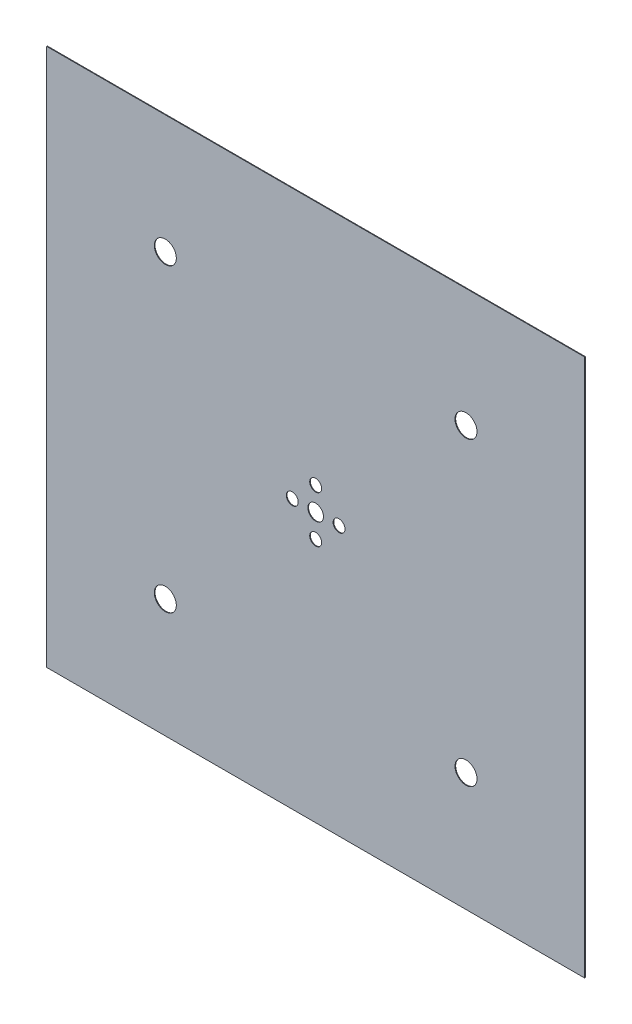
ISO-10303-21;
HEADER;
FILE_DESCRIPTION(('STEP AP214'),'2;1');
FILE_NAME('part.step','',(''),(''),'','','');
FILE_SCHEMA(('AUTOMOTIVE_DESIGN { 1 0 10303 214 1 1 1 1 }'));
ENDSEC;
DATA;
#1=APPLICATION_CONTEXT('core data for automotive mechanical design processes');
#2=APPLICATION_PROTOCOL_DEFINITION('international standard','automotive_design',2000,#1);
#3=PRODUCT_CONTEXT('',#1,'mechanical');
#4=PRODUCT('Part','Part','',(#3));
#5=PRODUCT_RELATED_PRODUCT_CATEGORY('part','',(#4));
#6=PRODUCT_DEFINITION_FORMATION('','',#4);
#7=PRODUCT_DEFINITION_CONTEXT('part definition',#1,'design');
#8=PRODUCT_DEFINITION('design','',#6,#7);
#9=PRODUCT_DEFINITION_SHAPE('','',#8);
#10=(LENGTH_UNIT() NAMED_UNIT(*) SI_UNIT(.MILLI.,.METRE.));
#11=(NAMED_UNIT(*) PLANE_ANGLE_UNIT() SI_UNIT($,.RADIAN.));
#12=(NAMED_UNIT(*) SI_UNIT($,.STERADIAN.) SOLID_ANGLE_UNIT());
#13=UNCERTAINTY_MEASURE_WITH_UNIT(LENGTH_MEASURE(1.E-05),#10,'distance_accuracy_value','');
#14=(GEOMETRIC_REPRESENTATION_CONTEXT(3) GLOBAL_UNCERTAINTY_ASSIGNED_CONTEXT((#13)) GLOBAL_UNIT_ASSIGNED_CONTEXT((#10,
#11,#12)) REPRESENTATION_CONTEXT('',''));
#15=CARTESIAN_POINT('',(0.,0.,0.));
#16=DIRECTION('',(0.,0.,1.));
#17=DIRECTION('',(1.,0.,0.));
#18=AXIS2_PLACEMENT_3D('',#15,#16,#17);
#19=CARTESIAN_POINT('',(0.,0.,4.));
#20=DIRECTION('',(0.,0.,1.));
#21=DIRECTION('',(1.,0.,0.));
#22=AXIS2_PLACEMENT_3D('',#19,#20,#21);
#23=PLANE('',#22);
#24=CARTESIAN_POINT('',(900.,-900.,4.));
#25=DIRECTION('',(0.,0.,1.));
#26=DIRECTION('',(-1.,0.,0.));
#27=AXIS2_PLACEMENT_3D('',#24,#25,#26);
#28=CIRCLE('',#27,65.8000000000008);
#29=CARTESIAN_POINT('',(834.199999999999,-900.,4.));
#30=VERTEX_POINT('',#29);
#31=EDGE_CURVE('E157',#30,#30,#28,.T.);
#32=ORIENTED_EDGE('',*,*,#31,.F.);
#33=EDGE_LOOP('',(#32));
#34=FACE_BOUND('',#33,.T.);
#35=CARTESIAN_POINT('',(140.,-1.11022302462516E-13,4.));
#36=DIRECTION('',(0.,0.,1.));
#37=DIRECTION('',(-1.,0.,0.));
#38=AXIS2_PLACEMENT_3D('',#35,#36,#37);
#39=CIRCLE('',#38,35.6375000000003);
#40=CARTESIAN_POINT('',(104.3625,-1.11022302462516E-13,4.));
#41=VERTEX_POINT('',#40);
#42=EDGE_CURVE('E145',#41,#41,#39,.T.);
#43=ORIENTED_EDGE('',*,*,#42,.F.);
#44=EDGE_LOOP('',(#43));
#45=FACE_BOUND('',#44,.T.);
#46=CARTESIAN_POINT('',(1.80023079474661E-13,-140.,4.));
#47=DIRECTION('',(0.,0.,1.));
#48=DIRECTION('',(-1.,0.,0.));
#49=AXIS2_PLACEMENT_3D('',#46,#47,#48);
#50=CIRCLE('',#49,35.6375);
#51=CARTESIAN_POINT('',(-35.6374999999998,-140.,4.));
#52=VERTEX_POINT('',#51);
#53=EDGE_CURVE('E133',#52,#52,#50,.T.);
#54=ORIENTED_EDGE('',*,*,#53,.F.);
#55=EDGE_LOOP('',(#54));
#56=FACE_BOUND('',#55,.T.);
#57=CARTESIAN_POINT('',(1.80023079474661E-13,140.,4.));
#58=DIRECTION('',(0.,0.,1.));
#59=DIRECTION('',(1.,0.,0.));
#60=AXIS2_PLACEMENT_3D('',#57,#58,#59);
#61=CIRCLE('',#60,35.6375);
#62=CARTESIAN_POINT('',(35.6375000000002,140.,4.));
#63=VERTEX_POINT('',#62);
#64=EDGE_CURVE('E121',#63,#63,#61,.T.);
#65=ORIENTED_EDGE('',*,*,#64,.F.);
#66=EDGE_LOOP('',(#65));
#67=FACE_BOUND('',#66,.T.);
#68=DIRECTION('',(0.,1.,0.));
#69=VECTOR('',#68,1.);
#70=CARTESIAN_POINT('',(1610.,1610.,4.));
#71=LINE('',#70,#69);
#72=CARTESIAN_POINT('',(1610.,-1610.,4.));
#73=VERTEX_POINT('',#72);
#74=CARTESIAN_POINT('',(1610.,1610.,4.));
#75=VERTEX_POINT('',#74);
#76=EDGE_CURVE('E91',#73,#75,#71,.T.);
#77=ORIENTED_EDGE('',*,*,#76,.T.);
#78=DIRECTION('',(-1.,0.,0.));
#79=VECTOR('',#78,1.);
#80=CARTESIAN_POINT('',(-1610.,1610.,4.));
#81=LINE('',#80,#79);
#82=CARTESIAN_POINT('',(-1610.,1610.,4.));
#83=VERTEX_POINT('',#82);
#84=EDGE_CURVE('E86',#75,#83,#81,.T.);
#85=ORIENTED_EDGE('',*,*,#84,.T.);
#86=DIRECTION('',(0.,-1.,0.));
#87=VECTOR('',#86,1.);
#88=CARTESIAN_POINT('',(-1610.,1610.,4.));
#89=LINE('',#88,#87);
#90=CARTESIAN_POINT('',(-1610.,-1610.,4.));
#91=VERTEX_POINT('',#90);
#92=EDGE_CURVE('E89',#83,#91,#89,.T.);
#93=ORIENTED_EDGE('',*,*,#92,.T.);
#94=DIRECTION('',(1.,0.,0.));
#95=VECTOR('',#94,1.);
#96=CARTESIAN_POINT('',(-1610.,-1610.,4.));
#97=LINE('',#96,#95);
#98=EDGE_CURVE('E56',#91,#73,#97,.T.);
#99=ORIENTED_EDGE('',*,*,#98,.T.);
#100=EDGE_LOOP('',(#77,#85,#93,#99));
#101=FACE_BOUND('',#100,.T.);
#102=CARTESIAN_POINT('',(0.,-2.22044604925031E-13,4.));
#103=DIRECTION('',(0.,0.,1.));
#104=DIRECTION('',(1.,0.,0.));
#105=AXIS2_PLACEMENT_3D('',#102,#103,#104);
#106=CIRCLE('',#105,46.75);
#107=CARTESIAN_POINT('',(46.75,-2.22044604925031E-13,4.));
#108=VERTEX_POINT('',#107);
#109=EDGE_CURVE('E106',#108,#108,#106,.T.);
#110=ORIENTED_EDGE('',*,*,#109,.F.);
#111=EDGE_LOOP('',(#110));
#112=FACE_BOUND('',#111,.T.);
#113=CARTESIAN_POINT('',(-900.,900.,4.));
#114=DIRECTION('',(0.,0.,1.));
#115=DIRECTION('',(1.,0.,0.));
#116=AXIS2_PLACEMENT_3D('',#113,#114,#115);
#117=CIRCLE('',#116,65.8000000000001);
#118=CARTESIAN_POINT('',(-834.2,900.,4.));
#119=VERTEX_POINT('',#118);
#120=EDGE_CURVE('E127',#119,#119,#117,.T.);
#121=ORIENTED_EDGE('',*,*,#120,.F.);
#122=EDGE_LOOP('',(#121));
#123=FACE_BOUND('',#122,.T.);
#124=CARTESIAN_POINT('',(-900.,-900.,4.));
#125=DIRECTION('',(0.,0.,1.));
#126=DIRECTION('',(-1.,0.,0.));
#127=AXIS2_PLACEMENT_3D('',#124,#125,#126);
#128=CIRCLE('',#127,65.8000000000001);
#129=CARTESIAN_POINT('',(-965.8,-900.,4.));
#130=VERTEX_POINT('',#129);
#131=EDGE_CURVE('E139',#130,#130,#128,.T.);
#132=ORIENTED_EDGE('',*,*,#131,.F.);
#133=EDGE_LOOP('',(#132));
#134=FACE_BOUND('',#133,.T.);
#135=CARTESIAN_POINT('',(-140.000000000001,-3.33066907387547E-13,4.));
#136=DIRECTION('',(0.,0.,1.));
#137=DIRECTION('',(1.,0.,0.));
#138=AXIS2_PLACEMENT_3D('',#135,#136,#137);
#139=CIRCLE('',#138,35.6375000000004);
#140=CARTESIAN_POINT('',(-104.3625,-3.33066907387547E-13,4.));
#141=VERTEX_POINT('',#140);
#142=EDGE_CURVE('E151',#141,#141,#139,.T.);
#143=ORIENTED_EDGE('',*,*,#142,.F.);
#144=EDGE_LOOP('',(#143));
#145=FACE_BOUND('',#144,.T.);
#146=CARTESIAN_POINT('',(900.,900.,4.));
#147=DIRECTION('',(0.,0.,1.));
#148=DIRECTION('',(1.,0.,0.));
#149=AXIS2_PLACEMENT_3D('',#146,#147,#148);
#150=CIRCLE('',#149,65.8000000000008);
#151=CARTESIAN_POINT('',(965.800000000001,900.,4.));
#152=VERTEX_POINT('',#151);
#153=EDGE_CURVE('E163',#152,#152,#150,.T.);
#154=ORIENTED_EDGE('',*,*,#153,.F.);
#155=EDGE_LOOP('',(#154));
#156=FACE_BOUND('',#155,.T.);
#157=ADVANCED_FACE('F39',(#34,#45,#56,#67,#101,#112,#123,#134,#145,#156),#23,.T.);
#158=CARTESIAN_POINT('',(0.,0.,0.));
#159=DIRECTION('',(0.,0.,1.));
#160=DIRECTION('',(1.,0.,0.));
#161=AXIS2_PLACEMENT_3D('',#158,#159,#160);
#162=PLANE('',#161);
#163=DIRECTION('',(0.,1.,0.));
#164=VECTOR('',#163,1.);
#165=CARTESIAN_POINT('',(1610.,1610.,0.));
#166=LINE('',#165,#164);
#167=CARTESIAN_POINT('',(1610.,-1610.,0.));
#168=VERTEX_POINT('',#167);
#169=CARTESIAN_POINT('',(1610.,1610.,0.));
#170=VERTEX_POINT('',#169);
#171=EDGE_CURVE('E103',#168,#170,#166,.T.);
#172=ORIENTED_EDGE('',*,*,#171,.F.);
#173=DIRECTION('',(1.,0.,0.));
#174=VECTOR('',#173,1.);
#175=CARTESIAN_POINT('',(-1610.,-1610.,0.));
#176=LINE('',#175,#174);
#177=CARTESIAN_POINT('',(-1610.,-1610.,0.));
#178=VERTEX_POINT('',#177);
#179=EDGE_CURVE('E79',#178,#168,#176,.T.);
#180=ORIENTED_EDGE('',*,*,#179,.F.);
#181=DIRECTION('',(0.,-1.,0.));
#182=VECTOR('',#181,1.);
#183=CARTESIAN_POINT('',(-1610.,1610.,0.));
#184=LINE('',#183,#182);
#185=CARTESIAN_POINT('',(-1610.,1610.,0.));
#186=VERTEX_POINT('',#185);
#187=EDGE_CURVE('E73',#186,#178,#184,.T.);
#188=ORIENTED_EDGE('',*,*,#187,.F.);
#189=DIRECTION('',(-1.,0.,0.));
#190=VECTOR('',#189,1.);
#191=CARTESIAN_POINT('',(-1610.,1610.,0.));
#192=LINE('',#191,#190);
#193=EDGE_CURVE('E95',#170,#186,#192,.T.);
#194=ORIENTED_EDGE('',*,*,#193,.F.);
#195=EDGE_LOOP('',(#172,#180,#188,#194));
#196=FACE_BOUND('',#195,.T.);
#197=CARTESIAN_POINT('',(0.,-2.22044604925031E-13,0.));
#198=DIRECTION('',(0.,0.,1.));
#199=DIRECTION('',(1.,0.,0.));
#200=AXIS2_PLACEMENT_3D('',#197,#198,#199);
#201=CIRCLE('',#200,46.75);
#202=CARTESIAN_POINT('',(46.75,-2.22044604925031E-13,0.));
#203=VERTEX_POINT('',#202);
#204=EDGE_CURVE('E118',#203,#203,#201,.T.);
#205=ORIENTED_EDGE('',*,*,#204,.T.);
#206=EDGE_LOOP('',(#205));
#207=FACE_BOUND('',#206,.T.);
#208=CARTESIAN_POINT('',(1.80023079474661E-13,140.,0.));
#209=DIRECTION('',(0.,0.,1.));
#210=DIRECTION('',(1.,0.,0.));
#211=AXIS2_PLACEMENT_3D('',#208,#209,#210);
#212=CIRCLE('',#211,35.6375);
#213=CARTESIAN_POINT('',(35.6375000000002,140.,0.));
#214=VERTEX_POINT('',#213);
#215=EDGE_CURVE('E124',#214,#214,#212,.T.);
#216=ORIENTED_EDGE('',*,*,#215,.T.);
#217=EDGE_LOOP('',(#216));
#218=FACE_BOUND('',#217,.T.);
#219=CARTESIAN_POINT('',(-900.,900.,0.));
#220=DIRECTION('',(0.,0.,1.));
#221=DIRECTION('',(1.,0.,0.));
#222=AXIS2_PLACEMENT_3D('',#219,#220,#221);
#223=CIRCLE('',#222,65.8000000000001);
#224=CARTESIAN_POINT('',(-834.2,900.,0.));
#225=VERTEX_POINT('',#224);
#226=EDGE_CURVE('E130',#225,#225,#223,.T.);
#227=ORIENTED_EDGE('',*,*,#226,.T.);
#228=EDGE_LOOP('',(#227));
#229=FACE_BOUND('',#228,.T.);
#230=CARTESIAN_POINT('',(1.80023079474661E-13,-140.,0.));
#231=DIRECTION('',(0.,0.,1.));
#232=DIRECTION('',(-1.,0.,0.));
#233=AXIS2_PLACEMENT_3D('',#230,#231,#232);
#234=CIRCLE('',#233,35.6375);
#235=CARTESIAN_POINT('',(-35.6374999999998,-140.,0.));
#236=VERTEX_POINT('',#235);
#237=EDGE_CURVE('E136',#236,#236,#234,.T.);
#238=ORIENTED_EDGE('',*,*,#237,.T.);
#239=EDGE_LOOP('',(#238));
#240=FACE_BOUND('',#239,.T.);
#241=CARTESIAN_POINT('',(-900.,-900.,0.));
#242=DIRECTION('',(0.,0.,1.));
#243=DIRECTION('',(-1.,0.,0.));
#244=AXIS2_PLACEMENT_3D('',#241,#242,#243);
#245=CIRCLE('',#244,65.8000000000001);
#246=CARTESIAN_POINT('',(-965.8,-900.,0.));
#247=VERTEX_POINT('',#246);
#248=EDGE_CURVE('E142',#247,#247,#245,.T.);
#249=ORIENTED_EDGE('',*,*,#248,.T.);
#250=EDGE_LOOP('',(#249));
#251=FACE_BOUND('',#250,.T.);
#252=CARTESIAN_POINT('',(140.,-1.11022302462516E-13,0.));
#253=DIRECTION('',(0.,0.,1.));
#254=DIRECTION('',(-1.,0.,0.));
#255=AXIS2_PLACEMENT_3D('',#252,#253,#254);
#256=CIRCLE('',#255,35.6375000000003);
#257=CARTESIAN_POINT('',(104.3625,-1.11022302462516E-13,0.));
#258=VERTEX_POINT('',#257);
#259=EDGE_CURVE('E148',#258,#258,#256,.T.);
#260=ORIENTED_EDGE('',*,*,#259,.T.);
#261=EDGE_LOOP('',(#260));
#262=FACE_BOUND('',#261,.T.);
#263=CARTESIAN_POINT('',(-140.000000000001,-3.33066907387547E-13,0.));
#264=DIRECTION('',(0.,0.,1.));
#265=DIRECTION('',(1.,0.,0.));
#266=AXIS2_PLACEMENT_3D('',#263,#264,#265);
#267=CIRCLE('',#266,35.6375000000004);
#268=CARTESIAN_POINT('',(-104.3625,-3.33066907387547E-13,0.));
#269=VERTEX_POINT('',#268);
#270=EDGE_CURVE('E154',#269,#269,#267,.T.);
#271=ORIENTED_EDGE('',*,*,#270,.T.);
#272=EDGE_LOOP('',(#271));
#273=FACE_BOUND('',#272,.T.);
#274=CARTESIAN_POINT('',(900.,-900.,0.));
#275=DIRECTION('',(0.,0.,1.));
#276=DIRECTION('',(-1.,0.,0.));
#277=AXIS2_PLACEMENT_3D('',#274,#275,#276);
#278=CIRCLE('',#277,65.8000000000008);
#279=CARTESIAN_POINT('',(834.199999999999,-900.,0.));
#280=VERTEX_POINT('',#279);
#281=EDGE_CURVE('E160',#280,#280,#278,.T.);
#282=ORIENTED_EDGE('',*,*,#281,.T.);
#283=EDGE_LOOP('',(#282));
#284=FACE_BOUND('',#283,.T.);
#285=CARTESIAN_POINT('',(900.,900.,0.));
#286=DIRECTION('',(0.,0.,1.));
#287=DIRECTION('',(1.,0.,0.));
#288=AXIS2_PLACEMENT_3D('',#285,#286,#287);
#289=CIRCLE('',#288,65.8000000000008);
#290=CARTESIAN_POINT('',(965.800000000001,900.,0.));
#291=VERTEX_POINT('',#290);
#292=EDGE_CURVE('E166',#291,#291,#289,.T.);
#293=ORIENTED_EDGE('',*,*,#292,.T.);
#294=EDGE_LOOP('',(#293));
#295=FACE_BOUND('',#294,.T.);
#296=ADVANCED_FACE('F114',(#196,#207,#218,#229,#240,#251,#262,#273,#284,#295),#162,.F.);
#297=CARTESIAN_POINT('',(1610.,1610.,4.));
#298=DIRECTION('',(-1.,0.,0.));
#299=DIRECTION('',(0.,-1.,0.));
#300=AXIS2_PLACEMENT_3D('',#297,#298,#299);
#301=PLANE('',#300);
#302=ORIENTED_EDGE('',*,*,#171,.T.);
#303=DIRECTION('',(0.,0.,-1.));
#304=VECTOR('',#303,1.);
#305=CARTESIAN_POINT('',(1610.,1610.,4.));
#306=LINE('',#305,#304);
#307=EDGE_CURVE('E11',#75,#170,#306,.T.);
#308=ORIENTED_EDGE('',*,*,#307,.F.);
#309=ORIENTED_EDGE('',*,*,#76,.F.);
#310=DIRECTION('',(0.,0.,-1.));
#311=VECTOR('',#310,1.);
#312=CARTESIAN_POINT('',(1610.,-1610.,4.));
#313=LINE('',#312,#311);
#314=EDGE_CURVE('E99',#73,#168,#313,.T.);
#315=ORIENTED_EDGE('',*,*,#314,.T.);
#316=EDGE_LOOP('',(#302,#308,#309,#315));
#317=FACE_BOUND('',#316,.T.);
#318=ADVANCED_FACE('F41',(#317),#301,.F.);
#319=CARTESIAN_POINT('',(-1610.,1610.,4.));
#320=DIRECTION('',(0.,-1.,0.));
#321=DIRECTION('',(0.,0.,-1.));
#322=AXIS2_PLACEMENT_3D('',#319,#320,#321);
#323=PLANE('',#322);
#324=ORIENTED_EDGE('',*,*,#193,.T.);
#325=DIRECTION('',(0.,0.,-1.));
#326=VECTOR('',#325,1.);
#327=CARTESIAN_POINT('',(-1610.,1610.,4.));
#328=LINE('',#327,#326);
#329=EDGE_CURVE('E48',#83,#186,#328,.T.);
#330=ORIENTED_EDGE('',*,*,#329,.F.);
#331=ORIENTED_EDGE('',*,*,#84,.F.);
#332=ORIENTED_EDGE('',*,*,#307,.T.);
#333=EDGE_LOOP('',(#324,#330,#331,#332));
#334=FACE_BOUND('',#333,.T.);
#335=ADVANCED_FACE('F94',(#334),#323,.F.);
#336=CARTESIAN_POINT('',(-1610.,1610.,4.));
#337=DIRECTION('',(1.,0.,0.));
#338=DIRECTION('',(0.,1.,0.));
#339=AXIS2_PLACEMENT_3D('',#336,#337,#338);
#340=PLANE('',#339);
#341=ORIENTED_EDGE('',*,*,#187,.T.);
#342=DIRECTION('',(0.,0.,-1.));
#343=VECTOR('',#342,1.);
#344=CARTESIAN_POINT('',(-1610.,-1610.,4.));
#345=LINE('',#344,#343);
#346=EDGE_CURVE('E96',#91,#178,#345,.T.);
#347=ORIENTED_EDGE('',*,*,#346,.F.);
#348=ORIENTED_EDGE('',*,*,#92,.F.);
#349=ORIENTED_EDGE('',*,*,#329,.T.);
#350=EDGE_LOOP('',(#341,#347,#348,#349));
#351=FACE_BOUND('',#350,.T.);
#352=ADVANCED_FACE('F97',(#351),#340,.F.);
#353=CARTESIAN_POINT('',(-1610.,-1610.,4.));
#354=DIRECTION('',(0.,1.,0.));
#355=DIRECTION('',(0.,0.,1.));
#356=AXIS2_PLACEMENT_3D('',#353,#354,#355);
#357=PLANE('',#356);
#358=ORIENTED_EDGE('',*,*,#179,.T.);
#359=ORIENTED_EDGE('',*,*,#314,.F.);
#360=ORIENTED_EDGE('',*,*,#98,.F.);
#361=ORIENTED_EDGE('',*,*,#346,.T.);
#362=EDGE_LOOP('',(#358,#359,#360,#361));
#363=FACE_BOUND('',#362,.T.);
#364=ADVANCED_FACE('F111',(#363),#357,.F.);
#365=CARTESIAN_POINT('',(0.,-2.22044604925031E-13,4.));
#366=DIRECTION('',(0.,0.,-1.));
#367=DIRECTION('',(-1.,0.,0.));
#368=AXIS2_PLACEMENT_3D('',#365,#366,#367);
#369=CYLINDRICAL_SURFACE('',#368,46.75);
#370=ORIENTED_EDGE('',*,*,#109,.T.);
#371=EDGE_LOOP('',(#370));
#372=FACE_BOUND('',#371,.T.);
#373=ORIENTED_EDGE('',*,*,#204,.F.);
#374=EDGE_LOOP('',(#373));
#375=FACE_BOUND('',#374,.T.);
#376=ADVANCED_FACE('F185',(#372,#375),#369,.F.);
#377=CARTESIAN_POINT('',(1.80023079474661E-13,140.,4.));
#378=DIRECTION('',(0.,0.,-1.));
#379=DIRECTION('',(-1.,0.,0.));
#380=AXIS2_PLACEMENT_3D('',#377,#378,#379);
#381=CYLINDRICAL_SURFACE('',#380,35.6375);
#382=ORIENTED_EDGE('',*,*,#64,.T.);
#383=EDGE_LOOP('',(#382));
#384=FACE_BOUND('',#383,.T.);
#385=ORIENTED_EDGE('',*,*,#215,.F.);
#386=EDGE_LOOP('',(#385));
#387=FACE_BOUND('',#386,.T.);
#388=ADVANCED_FACE('F239',(#384,#387),#381,.F.);
#389=CARTESIAN_POINT('',(-900.,900.,4.));
#390=DIRECTION('',(0.,0.,-1.));
#391=DIRECTION('',(-1.,0.,0.));
#392=AXIS2_PLACEMENT_3D('',#389,#390,#391);
#393=CYLINDRICAL_SURFACE('',#392,65.8000000000001);
#394=ORIENTED_EDGE('',*,*,#120,.T.);
#395=EDGE_LOOP('',(#394));
#396=FACE_BOUND('',#395,.T.);
#397=ORIENTED_EDGE('',*,*,#226,.F.);
#398=EDGE_LOOP('',(#397));
#399=FACE_BOUND('',#398,.T.);
#400=ADVANCED_FACE('F248',(#396,#399),#393,.F.);
#401=CARTESIAN_POINT('',(1.80023079474661E-13,-140.,4.));
#402=DIRECTION('',(0.,0.,-1.));
#403=DIRECTION('',(-1.,0.,0.));
#404=AXIS2_PLACEMENT_3D('',#401,#402,#403);
#405=CYLINDRICAL_SURFACE('',#404,35.6375);
#406=ORIENTED_EDGE('',*,*,#53,.T.);
#407=EDGE_LOOP('',(#406));
#408=FACE_BOUND('',#407,.T.);
#409=ORIENTED_EDGE('',*,*,#237,.F.);
#410=EDGE_LOOP('',(#409));
#411=FACE_BOUND('',#410,.T.);
#412=ADVANCED_FACE('F257',(#408,#411),#405,.F.);
#413=CARTESIAN_POINT('',(-900.,-900.,4.));
#414=DIRECTION('',(0.,0.,-1.));
#415=DIRECTION('',(-1.,0.,0.));
#416=AXIS2_PLACEMENT_3D('',#413,#414,#415);
#417=CYLINDRICAL_SURFACE('',#416,65.8000000000001);
#418=ORIENTED_EDGE('',*,*,#131,.T.);
#419=EDGE_LOOP('',(#418));
#420=FACE_BOUND('',#419,.T.);
#421=ORIENTED_EDGE('',*,*,#248,.F.);
#422=EDGE_LOOP('',(#421));
#423=FACE_BOUND('',#422,.T.);
#424=ADVANCED_FACE('F267',(#420,#423),#417,.F.);
#425=CARTESIAN_POINT('',(140.,-1.11022302462516E-13,4.));
#426=DIRECTION('',(0.,0.,-1.));
#427=DIRECTION('',(-1.,0.,0.));
#428=AXIS2_PLACEMENT_3D('',#425,#426,#427);
#429=CYLINDRICAL_SURFACE('',#428,35.6375000000003);
#430=ORIENTED_EDGE('',*,*,#42,.T.);
#431=EDGE_LOOP('',(#430));
#432=FACE_BOUND('',#431,.T.);
#433=ORIENTED_EDGE('',*,*,#259,.F.);
#434=EDGE_LOOP('',(#433));
#435=FACE_BOUND('',#434,.T.);
#436=ADVANCED_FACE('F277',(#432,#435),#429,.F.);
#437=CARTESIAN_POINT('',(-140.000000000001,-3.33066907387547E-13,4.));
#438=DIRECTION('',(0.,0.,-1.));
#439=DIRECTION('',(-1.,0.,0.));
#440=AXIS2_PLACEMENT_3D('',#437,#438,#439);
#441=CYLINDRICAL_SURFACE('',#440,35.6375000000004);
#442=ORIENTED_EDGE('',*,*,#142,.T.);
#443=EDGE_LOOP('',(#442));
#444=FACE_BOUND('',#443,.T.);
#445=ORIENTED_EDGE('',*,*,#270,.F.);
#446=EDGE_LOOP('',(#445));
#447=FACE_BOUND('',#446,.T.);
#448=ADVANCED_FACE('F287',(#444,#447),#441,.F.);
#449=CARTESIAN_POINT('',(900.,-900.,4.));
#450=DIRECTION('',(0.,0.,-1.));
#451=DIRECTION('',(-1.,0.,0.));
#452=AXIS2_PLACEMENT_3D('',#449,#450,#451);
#453=CYLINDRICAL_SURFACE('',#452,65.8000000000008);
#454=ORIENTED_EDGE('',*,*,#31,.T.);
#455=EDGE_LOOP('',(#454));
#456=FACE_BOUND('',#455,.T.);
#457=ORIENTED_EDGE('',*,*,#281,.F.);
#458=EDGE_LOOP('',(#457));
#459=FACE_BOUND('',#458,.T.);
#460=ADVANCED_FACE('F297',(#456,#459),#453,.F.);
#461=CARTESIAN_POINT('',(900.,900.,4.));
#462=DIRECTION('',(0.,0.,-1.));
#463=DIRECTION('',(-1.,0.,0.));
#464=AXIS2_PLACEMENT_3D('',#461,#462,#463);
#465=CYLINDRICAL_SURFACE('',#464,65.8000000000008);
#466=ORIENTED_EDGE('',*,*,#153,.T.);
#467=EDGE_LOOP('',(#466));
#468=FACE_BOUND('',#467,.T.);
#469=ORIENTED_EDGE('',*,*,#292,.F.);
#470=EDGE_LOOP('',(#469));
#471=FACE_BOUND('',#470,.T.);
#472=ADVANCED_FACE('F172',(#468,#471),#465,.F.);
#473=CLOSED_SHELL('',(#157,#296,#318,#335,#352,#364,#376,#388,#400,#412,#424,#436,#448,#460,#472));
#474=MANIFOLD_SOLID_BREP('B2',#473);
#475=ADVANCED_BREP_SHAPE_REPRESENTATION('',(#18,#474),#14);
#476=SHAPE_DEFINITION_REPRESENTATION(#9,#475);
ENDSEC;
END-ISO-10303-21;
